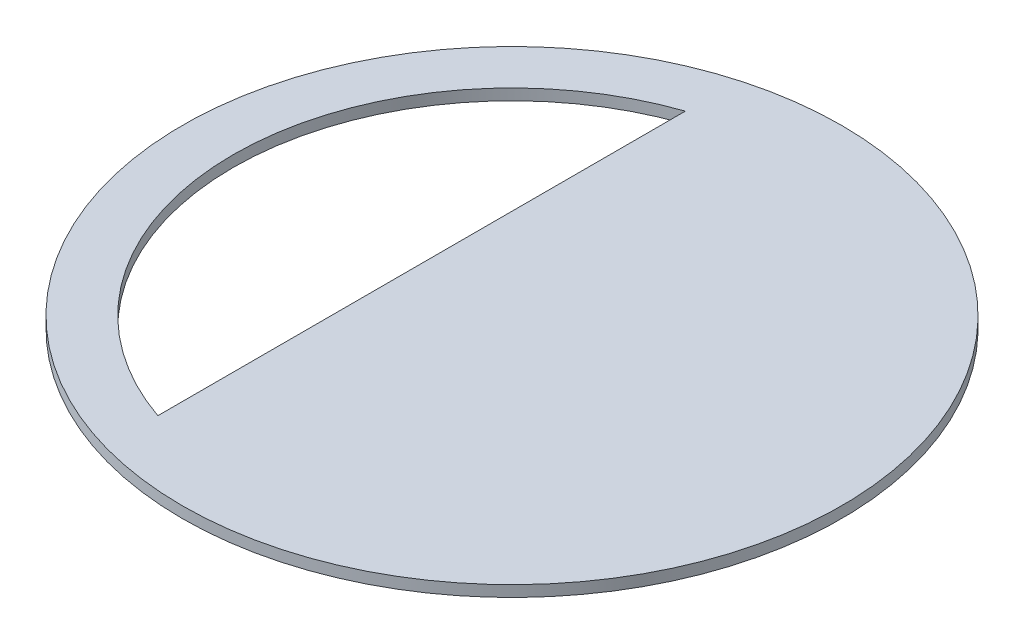
ISO-10303-21;
HEADER;
FILE_DESCRIPTION(('STEP AP214'),'2;1');
FILE_NAME('part.step','',(''),(''),'','','');
FILE_SCHEMA(('AUTOMOTIVE_DESIGN { 1 0 10303 214 1 1 1 1 }'));
ENDSEC;
DATA;
#1=APPLICATION_CONTEXT('core data for automotive mechanical design processes');
#2=APPLICATION_PROTOCOL_DEFINITION('international standard','automotive_design',2000,#1);
#3=PRODUCT_CONTEXT('',#1,'mechanical');
#4=PRODUCT('Part','Part','',(#3));
#5=PRODUCT_RELATED_PRODUCT_CATEGORY('part','',(#4));
#6=PRODUCT_DEFINITION_FORMATION('','',#4);
#7=PRODUCT_DEFINITION_CONTEXT('part definition',#1,'design');
#8=PRODUCT_DEFINITION('design','',#6,#7);
#9=PRODUCT_DEFINITION_SHAPE('','',#8);
#10=(LENGTH_UNIT() NAMED_UNIT(*) SI_UNIT(.MILLI.,.METRE.));
#11=(NAMED_UNIT(*) PLANE_ANGLE_UNIT() SI_UNIT($,.RADIAN.));
#12=(NAMED_UNIT(*) SI_UNIT($,.STERADIAN.) SOLID_ANGLE_UNIT());
#13=UNCERTAINTY_MEASURE_WITH_UNIT(LENGTH_MEASURE(1.E-05),#10,'distance_accuracy_value','');
#14=(GEOMETRIC_REPRESENTATION_CONTEXT(3) GLOBAL_UNCERTAINTY_ASSIGNED_CONTEXT((#13)) GLOBAL_UNIT_ASSIGNED_CONTEXT((#10,
#11,#12)) REPRESENTATION_CONTEXT('',''));
#15=CARTESIAN_POINT('',(0.,0.,0.));
#16=DIRECTION('',(0.,0.,1.));
#17=DIRECTION('',(1.,0.,0.));
#18=AXIS2_PLACEMENT_3D('',#15,#16,#17);
#19=CARTESIAN_POINT('',(0.,2.032,0.));
#20=DIRECTION('',(0.,1.,0.));
#21=DIRECTION('',(0.,0.,1.));
#22=AXIS2_PLACEMENT_3D('',#19,#20,#21);
#23=PLANE('',#22);
#24=CARTESIAN_POINT('',(0.,2.032,0.));
#25=DIRECTION('',(0.,1.,0.));
#26=DIRECTION('',(0.,0.,1.));
#27=AXIS2_PLACEMENT_3D('',#24,#25,#26);
#28=CIRCLE('',#27,60.198);
#29=CARTESIAN_POINT('',(0.,2.032,60.198));
#30=VERTEX_POINT('',#29);
#31=EDGE_CURVE('E11',#30,#30,#28,.T.);
#32=ORIENTED_EDGE('',*,*,#31,.T.);
#33=EDGE_LOOP('',(#32));
#34=FACE_BOUND('',#33,.T.);
#35=CARTESIAN_POINT('',(0.,2.032,0.));
#36=DIRECTION('',(0.,1.,0.));
#37=DIRECTION('',(0.,0.,1.));
#38=AXIS2_PLACEMENT_3D('',#35,#36,#37);
#39=CIRCLE('',#38,50.927);
#40=CARTESIAN_POINT('',(-16.51,2.032,-48.1765423105478));
#41=VERTEX_POINT('',#40);
#42=CARTESIAN_POINT('',(-16.51,2.032,48.1765423105478));
#43=VERTEX_POINT('',#42);
#44=EDGE_CURVE('E67',#41,#43,#39,.T.);
#45=ORIENTED_EDGE('',*,*,#44,.F.);
#46=DIRECTION('',(0.,0.,1.));
#47=VECTOR('',#46,1.);
#48=CARTESIAN_POINT('',(-16.51,2.032,0.));
#49=LINE('',#48,#47);
#50=EDGE_CURVE('E48',#41,#43,#49,.T.);
#51=ORIENTED_EDGE('',*,*,#50,.T.);
#52=EDGE_LOOP('',(#45,#51));
#53=FACE_BOUND('',#52,.T.);
#54=ADVANCED_FACE('F33',(#34,#53),#23,.T.);
#55=CARTESIAN_POINT('',(0.,0.,0.));
#56=DIRECTION('',(0.,1.,0.));
#57=DIRECTION('',(0.,0.,1.));
#58=AXIS2_PLACEMENT_3D('',#55,#56,#57);
#59=PLANE('',#58);
#60=CARTESIAN_POINT('',(0.,0.,0.));
#61=DIRECTION('',(0.,1.,0.));
#62=DIRECTION('',(0.,0.,1.));
#63=AXIS2_PLACEMENT_3D('',#60,#61,#62);
#64=CIRCLE('',#63,60.198);
#65=CARTESIAN_POINT('',(0.,0.,60.198));
#66=VERTEX_POINT('',#65);
#67=EDGE_CURVE('E37',#66,#66,#64,.T.);
#68=ORIENTED_EDGE('',*,*,#67,.F.);
#69=EDGE_LOOP('',(#68));
#70=FACE_BOUND('',#69,.T.);
#71=DIRECTION('',(0.,0.,1.));
#72=VECTOR('',#71,1.);
#73=CARTESIAN_POINT('',(-16.51,0.,0.));
#74=LINE('',#73,#72);
#75=CARTESIAN_POINT('',(-16.51,0.,-48.1765423105478));
#76=VERTEX_POINT('',#75);
#77=CARTESIAN_POINT('',(-16.51,0.,48.1765423105478));
#78=VERTEX_POINT('',#77);
#79=EDGE_CURVE('E62',#76,#78,#74,.T.);
#80=ORIENTED_EDGE('',*,*,#79,.F.);
#81=CARTESIAN_POINT('',(0.,0.,0.));
#82=DIRECTION('',(0.,1.,0.));
#83=DIRECTION('',(0.,0.,1.));
#84=AXIS2_PLACEMENT_3D('',#81,#82,#83);
#85=CIRCLE('',#84,50.927);
#86=EDGE_CURVE('E73',#76,#78,#85,.T.);
#87=ORIENTED_EDGE('',*,*,#86,.T.);
#88=EDGE_LOOP('',(#80,#87));
#89=FACE_BOUND('',#88,.T.);
#90=ADVANCED_FACE('F77',(#70,#89),#59,.F.);
#91=CARTESIAN_POINT('',(0.,2.032,0.));
#92=DIRECTION('',(0.,-1.,0.));
#93=DIRECTION('',(0.,0.,-1.));
#94=AXIS2_PLACEMENT_3D('',#91,#92,#93);
#95=CYLINDRICAL_SURFACE('',#94,60.198);
#96=ORIENTED_EDGE('',*,*,#31,.F.);
#97=EDGE_LOOP('',(#96));
#98=FACE_BOUND('',#97,.T.);
#99=ORIENTED_EDGE('',*,*,#67,.T.);
#100=EDGE_LOOP('',(#99));
#101=FACE_BOUND('',#100,.T.);
#102=ADVANCED_FACE('F35',(#98,#101),#95,.T.);
#103=CARTESIAN_POINT('',(-16.51,0.,0.));
#104=DIRECTION('',(-1.,0.,0.));
#105=DIRECTION('',(0.,0.,1.));
#106=AXIS2_PLACEMENT_3D('',#103,#104,#105);
#107=PLANE('',#106);
#108=ORIENTED_EDGE('',*,*,#50,.F.);
#109=DIRECTION('',(0.,1.,0.));
#110=VECTOR('',#109,1.);
#111=CARTESIAN_POINT('',(-16.51,0.,-48.1765423105478));
#112=LINE('',#111,#110);
#113=EDGE_CURVE('E64',#76,#41,#112,.T.);
#114=ORIENTED_EDGE('',*,*,#113,.F.);
#115=ORIENTED_EDGE('',*,*,#79,.T.);
#116=DIRECTION('',(0.,1.,0.));
#117=VECTOR('',#116,1.);
#118=CARTESIAN_POINT('',(-16.51,0.,48.1765423105478));
#119=LINE('',#118,#117);
#120=EDGE_CURVE('E55',#78,#43,#119,.T.);
#121=ORIENTED_EDGE('',*,*,#120,.T.);
#122=EDGE_LOOP('',(#108,#114,#115,#121));
#123=FACE_BOUND('',#122,.T.);
#124=ADVANCED_FACE('F60',(#123),#107,.T.);
#125=CARTESIAN_POINT('',(0.,0.,0.));
#126=DIRECTION('',(0.,1.,0.));
#127=DIRECTION('',(0.,0.,1.));
#128=AXIS2_PLACEMENT_3D('',#125,#126,#127);
#129=CYLINDRICAL_SURFACE('',#128,50.927);
#130=ORIENTED_EDGE('',*,*,#44,.T.);
#131=ORIENTED_EDGE('',*,*,#120,.F.);
#132=ORIENTED_EDGE('',*,*,#86,.F.);
#133=ORIENTED_EDGE('',*,*,#113,.T.);
#134=EDGE_LOOP('',(#130,#131,#132,#133));
#135=FACE_BOUND('',#134,.T.);
#136=ADVANCED_FACE('F68',(#135),#129,.F.);
#137=CLOSED_SHELL('',(#54,#90,#102,#124,#136));
#138=MANIFOLD_SOLID_BREP('B2',#137);
#139=ADVANCED_BREP_SHAPE_REPRESENTATION('',(#18,#138),#14);
#140=SHAPE_DEFINITION_REPRESENTATION(#9,#139);
ENDSEC;
END-ISO-10303-21;
